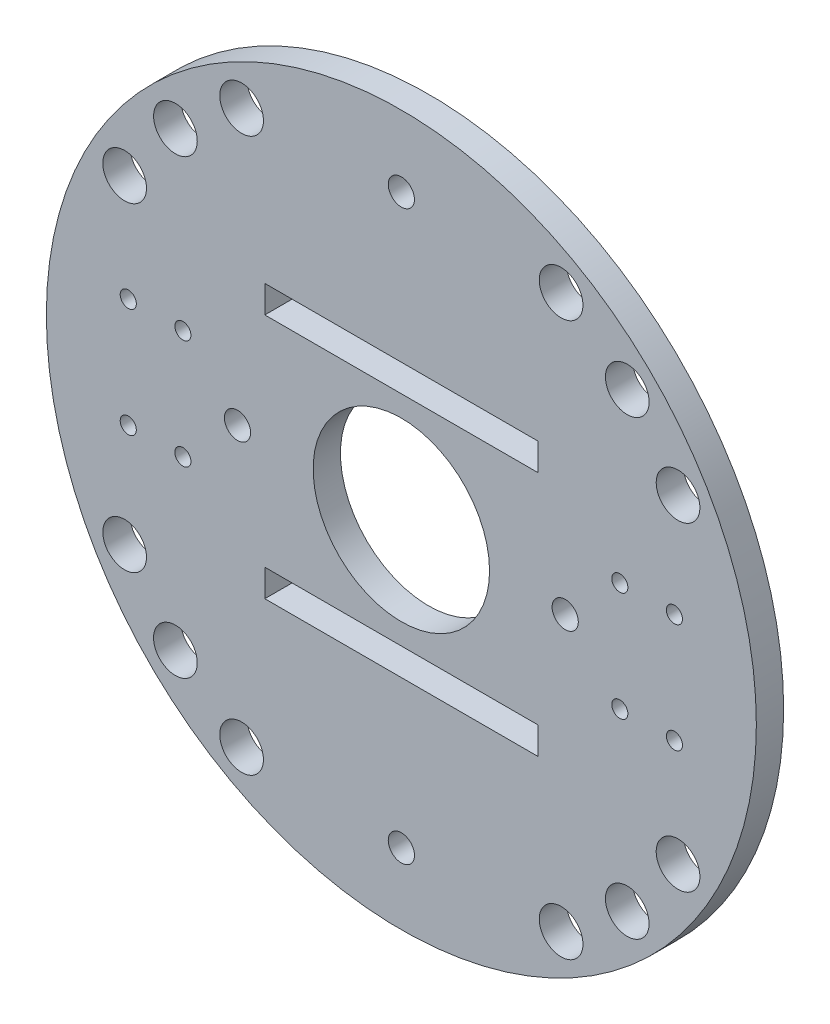
ISO-10303-21;
HEADER;
FILE_DESCRIPTION(('STEP AP214'),'2;1');
FILE_NAME('part.step','',(''),(''),'','','');
FILE_SCHEMA(('AUTOMOTIVE_DESIGN { 1 0 10303 214 1 1 1 1 }'));
ENDSEC;
DATA;
#1=APPLICATION_CONTEXT('core data for automotive mechanical design processes');
#2=APPLICATION_PROTOCOL_DEFINITION('international standard','automotive_design',2000,#1);
#3=PRODUCT_CONTEXT('',#1,'mechanical');
#4=PRODUCT('Part','Part','',(#3));
#5=PRODUCT_RELATED_PRODUCT_CATEGORY('part','',(#4));
#6=PRODUCT_DEFINITION_FORMATION('','',#4);
#7=PRODUCT_DEFINITION_CONTEXT('part definition',#1,'design');
#8=PRODUCT_DEFINITION('design','',#6,#7);
#9=PRODUCT_DEFINITION_SHAPE('','',#8);
#10=(LENGTH_UNIT() NAMED_UNIT(*) SI_UNIT(.MILLI.,.METRE.));
#11=(NAMED_UNIT(*) PLANE_ANGLE_UNIT() SI_UNIT($,.RADIAN.));
#12=(NAMED_UNIT(*) SI_UNIT($,.STERADIAN.) SOLID_ANGLE_UNIT());
#13=UNCERTAINTY_MEASURE_WITH_UNIT(LENGTH_MEASURE(1.E-05),#10,'distance_accuracy_value','');
#14=(GEOMETRIC_REPRESENTATION_CONTEXT(3) GLOBAL_UNCERTAINTY_ASSIGNED_CONTEXT((#13)) GLOBAL_UNIT_ASSIGNED_CONTEXT((#10,
#11,#12)) REPRESENTATION_CONTEXT('',''));
#15=CARTESIAN_POINT('',(0.,0.,0.));
#16=DIRECTION('',(0.,0.,1.));
#17=DIRECTION('',(1.,0.,0.));
#18=AXIS2_PLACEMENT_3D('',#15,#16,#17);
#19=CARTESIAN_POINT('',(0.,0.,5.));
#20=DIRECTION('',(0.,0.,1.));
#21=DIRECTION('',(1.,0.,0.));
#22=AXIS2_PLACEMENT_3D('',#19,#20,#21);
#23=PLANE('',#22);
#24=CARTESIAN_POINT('',(40.,9.99999999999999,5.));
#25=DIRECTION('',(0.,0.,1.));
#26=DIRECTION('',(-1.,0.,0.));
#27=AXIS2_PLACEMENT_3D('',#24,#25,#26);
#28=CIRCLE('',#27,1.475);
#29=CARTESIAN_POINT('',(38.525,9.99999999999999,5.));
#30=VERTEX_POINT('',#29);
#31=EDGE_CURVE('E223',#30,#30,#28,.T.);
#32=ORIENTED_EDGE('',*,*,#31,.F.);
#33=EDGE_LOOP('',(#32));
#34=FACE_BOUND('',#33,.T.);
#35=CARTESIAN_POINT('',(50.,-9.99999999999999,5.));
#36=DIRECTION('',(0.,0.,1.));
#37=DIRECTION('',(1.,0.,0.));
#38=AXIS2_PLACEMENT_3D('',#35,#36,#37);
#39=CIRCLE('',#38,1.475);
#40=CARTESIAN_POINT('',(51.475,-9.99999999999999,5.));
#41=VERTEX_POINT('',#40);
#42=EDGE_CURVE('E227',#41,#41,#39,.T.);
#43=ORIENTED_EDGE('',*,*,#42,.F.);
#44=EDGE_LOOP('',(#43));
#45=FACE_BOUND('',#44,.T.);
#46=CARTESIAN_POINT('',(-40.,-9.99999999999999,5.));
#47=DIRECTION('',(0.,0.,1.));
#48=DIRECTION('',(-1.,0.,0.));
#49=AXIS2_PLACEMENT_3D('',#46,#47,#48);
#50=CIRCLE('',#49,1.475);
#51=CARTESIAN_POINT('',(-41.475,-9.99999999999999,5.));
#52=VERTEX_POINT('',#51);
#53=EDGE_CURVE('E231',#52,#52,#50,.T.);
#54=ORIENTED_EDGE('',*,*,#53,.F.);
#55=EDGE_LOOP('',(#54));
#56=FACE_BOUND('',#55,.T.);
#57=CARTESIAN_POINT('',(-40.,9.99999999999999,5.));
#58=DIRECTION('',(0.,0.,1.));
#59=DIRECTION('',(1.,0.,0.));
#60=AXIS2_PLACEMENT_3D('',#57,#58,#59);
#61=CIRCLE('',#60,1.475);
#62=CARTESIAN_POINT('',(-38.525,9.99999999999999,5.));
#63=VERTEX_POINT('',#62);
#64=EDGE_CURVE('E235',#63,#63,#61,.T.);
#65=ORIENTED_EDGE('',*,*,#64,.F.);
#66=EDGE_LOOP('',(#65));
#67=FACE_BOUND('',#66,.T.);
#68=CARTESIAN_POINT('',(-41.3657466994133,-41.3657466994128,5.));
#69=DIRECTION('',(0.,0.,1.));
#70=DIRECTION('',(-1.,0.,0.));
#71=AXIS2_PLACEMENT_3D('',#68,#69,#70);
#72=CIRCLE('',#71,4.);
#73=CARTESIAN_POINT('',(-45.3657466994133,-41.3657466994128,5.));
#74=VERTEX_POINT('',#73);
#75=EDGE_CURVE('E239',#74,#74,#72,.T.);
#76=ORIENTED_EDGE('',*,*,#75,.F.);
#77=EDGE_LOOP('',(#76));
#78=FACE_BOUND('',#77,.T.);
#79=CARTESIAN_POINT('',(29.2500000000002,-50.6624861213895,5.));
#80=DIRECTION('',(0.,0.,1.));
#81=DIRECTION('',(1.,0.,0.));
#82=AXIS2_PLACEMENT_3D('',#79,#80,#81);
#83=CIRCLE('',#82,4.);
#84=CARTESIAN_POINT('',(33.2500000000002,-50.6624861213895,5.));
#85=VERTEX_POINT('',#84);
#86=EDGE_CURVE('E243',#85,#85,#83,.T.);
#87=ORIENTED_EDGE('',*,*,#86,.F.);
#88=EDGE_LOOP('',(#87));
#89=FACE_BOUND('',#88,.T.);
#90=CARTESIAN_POINT('',(50.6624861213898,-29.2499999999997,5.));
#91=DIRECTION('',(0.,0.,1.));
#92=DIRECTION('',(1.,0.,0.));
#93=AXIS2_PLACEMENT_3D('',#90,#91,#92);
#94=CIRCLE('',#93,4.);
#95=CARTESIAN_POINT('',(54.6624861213898,-29.2499999999997,5.));
#96=VERTEX_POINT('',#95);
#97=EDGE_CURVE('E247',#96,#96,#94,.T.);
#98=ORIENTED_EDGE('',*,*,#97,.F.);
#99=EDGE_LOOP('',(#98));
#100=FACE_BOUND('',#99,.T.);
#101=CARTESIAN_POINT('',(-50.6624861213898,29.2499999999997,5.));
#102=DIRECTION('',(0.,0.,1.));
#103=DIRECTION('',(1.,0.,0.));
#104=AXIS2_PLACEMENT_3D('',#101,#102,#103);
#105=CIRCLE('',#104,4.);
#106=CARTESIAN_POINT('',(-46.6624861213899,29.2499999999997,5.));
#107=VERTEX_POINT('',#106);
#108=EDGE_CURVE('E251',#107,#107,#105,.T.);
#109=ORIENTED_EDGE('',*,*,#108,.F.);
#110=EDGE_LOOP('',(#109));
#111=FACE_BOUND('',#110,.T.);
#112=CARTESIAN_POINT('',(50.6624861213898,29.2499999999997,5.));
#113=DIRECTION('',(0.,0.,1.));
#114=DIRECTION('',(-1.,0.,0.));
#115=AXIS2_PLACEMENT_3D('',#112,#113,#114);
#116=CIRCLE('',#115,4.);
#117=CARTESIAN_POINT('',(46.6624861213899,29.2499999999997,5.));
#118=VERTEX_POINT('',#117);
#119=EDGE_CURVE('E255',#118,#118,#116,.T.);
#120=ORIENTED_EDGE('',*,*,#119,.F.);
#121=EDGE_LOOP('',(#120));
#122=FACE_BOUND('',#121,.T.);
#123=CARTESIAN_POINT('',(-41.3657466994133,41.3657466994128,5.));
#124=DIRECTION('',(0.,0.,1.));
#125=DIRECTION('',(1.,0.,0.));
#126=AXIS2_PLACEMENT_3D('',#123,#124,#125);
#127=CIRCLE('',#126,4.);
#128=CARTESIAN_POINT('',(-37.3657466994133,41.3657466994128,5.));
#129=VERTEX_POINT('',#128);
#130=EDGE_CURVE('E126',#129,#129,#127,.T.);
#131=ORIENTED_EDGE('',*,*,#130,.F.);
#132=EDGE_LOOP('',(#131));
#133=FACE_BOUND('',#132,.T.);
#134=CARTESIAN_POINT('',(0.,-52.,5.));
#135=DIRECTION('',(0.,0.,1.));
#136=DIRECTION('',(-1.,0.,0.));
#137=AXIS2_PLACEMENT_3D('',#134,#135,#136);
#138=CIRCLE('',#137,2.4);
#139=CARTESIAN_POINT('',(-2.4,-52.,5.));
#140=VERTEX_POINT('',#139);
#141=EDGE_CURVE('E173',#140,#140,#138,.T.);
#142=ORIENTED_EDGE('',*,*,#141,.F.);
#143=EDGE_LOOP('',(#142));
#144=FACE_BOUND('',#143,.T.);
#145=CARTESIAN_POINT('',(0.,52.,5.));
#146=DIRECTION('',(0.,0.,1.));
#147=DIRECTION('',(1.,0.,0.));
#148=AXIS2_PLACEMENT_3D('',#145,#146,#147);
#149=CIRCLE('',#148,2.4);
#150=CARTESIAN_POINT('',(2.4,52.,5.));
#151=VERTEX_POINT('',#150);
#152=EDGE_CURVE('E185',#151,#151,#149,.T.);
#153=ORIENTED_EDGE('',*,*,#152,.F.);
#154=EDGE_LOOP('',(#153));
#155=FACE_BOUND('',#154,.T.);
#156=CARTESIAN_POINT('',(0.,0.,5.));
#157=DIRECTION('',(0.,0.,1.));
#158=DIRECTION('',(1.,0.,0.));
#159=AXIS2_PLACEMENT_3D('',#156,#157,#158);
#160=CIRCLE('',#159,65.);
#161=CARTESIAN_POINT('',(65.,0.,5.));
#162=VERTEX_POINT('',#161);
#163=EDGE_CURVE('E11',#162,#162,#160,.T.);
#164=ORIENTED_EDGE('',*,*,#163,.T.);
#165=EDGE_LOOP('',(#164));
#166=FACE_BOUND('',#165,.T.);
#167=CARTESIAN_POINT('',(0.,0.,5.));
#168=DIRECTION('',(0.,0.,1.));
#169=DIRECTION('',(1.,0.,0.));
#170=AXIS2_PLACEMENT_3D('',#167,#168,#169);
#171=CIRCLE('',#170,16.15);
#172=CARTESIAN_POINT('',(16.15,0.,5.));
#173=VERTEX_POINT('',#172);
#174=EDGE_CURVE('E191',#173,#173,#171,.T.);
#175=ORIENTED_EDGE('',*,*,#174,.F.);
#176=EDGE_LOOP('',(#175));
#177=FACE_BOUND('',#176,.T.);
#178=CARTESIAN_POINT('',(-30.,0.,5.));
#179=DIRECTION('',(0.,0.,1.));
#180=DIRECTION('',(1.,0.,0.));
#181=AXIS2_PLACEMENT_3D('',#178,#179,#180);
#182=CIRCLE('',#181,2.4);
#183=CARTESIAN_POINT('',(-27.6,0.,5.));
#184=VERTEX_POINT('',#183);
#185=EDGE_CURVE('E179',#184,#184,#182,.T.);
#186=ORIENTED_EDGE('',*,*,#185,.F.);
#187=EDGE_LOOP('',(#186));
#188=FACE_BOUND('',#187,.T.);
#189=CARTESIAN_POINT('',(30.,0.,5.));
#190=DIRECTION('',(0.,0.,1.));
#191=DIRECTION('',(-1.,0.,0.));
#192=AXIS2_PLACEMENT_3D('',#189,#190,#191);
#193=CIRCLE('',#192,2.4);
#194=CARTESIAN_POINT('',(27.6,0.,5.));
#195=VERTEX_POINT('',#194);
#196=EDGE_CURVE('E167',#195,#195,#193,.T.);
#197=ORIENTED_EDGE('',*,*,#196,.F.);
#198=EDGE_LOOP('',(#197));
#199=FACE_BOUND('',#198,.T.);
#200=DIRECTION('',(1.,0.,0.));
#201=VECTOR('',#200,1.);
#202=CARTESIAN_POINT('',(-25.,20.,5.));
#203=LINE('',#202,#201);
#204=CARTESIAN_POINT('',(-25.,20.,5.));
#205=VERTEX_POINT('',#204);
#206=CARTESIAN_POINT('',(25.,20.,5.));
#207=VERTEX_POINT('',#206);
#208=EDGE_CURVE('E138',#205,#207,#203,.T.);
#209=ORIENTED_EDGE('',*,*,#208,.F.);
#210=DIRECTION('',(0.,-1.,0.));
#211=VECTOR('',#210,1.);
#212=CARTESIAN_POINT('',(-25.,25.,5.));
#213=LINE('',#212,#211);
#214=CARTESIAN_POINT('',(-25.,25.,5.));
#215=VERTEX_POINT('',#214);
#216=EDGE_CURVE('E136',#215,#205,#213,.T.);
#217=ORIENTED_EDGE('',*,*,#216,.F.);
#218=DIRECTION('',(-1.,0.,0.));
#219=VECTOR('',#218,1.);
#220=CARTESIAN_POINT('',(-25.,25.,5.));
#221=LINE('',#220,#219);
#222=CARTESIAN_POINT('',(25.,25.,5.));
#223=VERTEX_POINT('',#222);
#224=EDGE_CURVE('E144',#223,#215,#221,.T.);
#225=ORIENTED_EDGE('',*,*,#224,.F.);
#226=DIRECTION('',(0.,1.,0.));
#227=VECTOR('',#226,1.);
#228=CARTESIAN_POINT('',(25.,25.,5.));
#229=LINE('',#228,#227);
#230=EDGE_CURVE('E141',#207,#223,#229,.T.);
#231=ORIENTED_EDGE('',*,*,#230,.F.);
#232=EDGE_LOOP('',(#209,#217,#225,#231));
#233=FACE_BOUND('',#232,.T.);
#234=DIRECTION('',(0.,1.,0.));
#235=VECTOR('',#234,1.);
#236=CARTESIAN_POINT('',(25.,-25.,5.));
#237=LINE('',#236,#235);
#238=CARTESIAN_POINT('',(25.,-25.,5.));
#239=VERTEX_POINT('',#238);
#240=CARTESIAN_POINT('',(25.,-20.,5.));
#241=VERTEX_POINT('',#240);
#242=EDGE_CURVE('E105',#239,#241,#237,.T.);
#243=ORIENTED_EDGE('',*,*,#242,.F.);
#244=DIRECTION('',(1.,0.,0.));
#245=VECTOR('',#244,1.);
#246=CARTESIAN_POINT('',(-25.,-25.,5.));
#247=LINE('',#246,#245);
#248=CARTESIAN_POINT('',(-25.,-25.,5.));
#249=VERTEX_POINT('',#248);
#250=EDGE_CURVE('E97',#249,#239,#247,.T.);
#251=ORIENTED_EDGE('',*,*,#250,.F.);
#252=DIRECTION('',(0.,-1.,0.));
#253=VECTOR('',#252,1.);
#254=CARTESIAN_POINT('',(-25.,-25.,5.));
#255=LINE('',#254,#253);
#256=CARTESIAN_POINT('',(-25.,-20.,5.));
#257=VERTEX_POINT('',#256);
#258=EDGE_CURVE('E120',#257,#249,#255,.T.);
#259=ORIENTED_EDGE('',*,*,#258,.F.);
#260=DIRECTION('',(-1.,0.,0.));
#261=VECTOR('',#260,1.);
#262=CARTESIAN_POINT('',(-25.,-20.,5.));
#263=LINE('',#262,#261);
#264=EDGE_CURVE('E118',#241,#257,#263,.T.);
#265=ORIENTED_EDGE('',*,*,#264,.F.);
#266=EDGE_LOOP('',(#243,#251,#259,#265));
#267=FACE_BOUND('',#266,.T.);
#268=CARTESIAN_POINT('',(-29.2500000000002,50.6624861213895,5.));
#269=DIRECTION('',(0.,0.,1.));
#270=DIRECTION('',(1.,0.,0.));
#271=AXIS2_PLACEMENT_3D('',#268,#269,#270);
#272=CIRCLE('',#271,4.);
#273=CARTESIAN_POINT('',(-25.2500000000002,50.6624861213895,5.));
#274=VERTEX_POINT('',#273);
#275=EDGE_CURVE('E459',#274,#274,#272,.T.);
#276=ORIENTED_EDGE('',*,*,#275,.F.);
#277=EDGE_LOOP('',(#276));
#278=FACE_BOUND('',#277,.T.);
#279=CARTESIAN_POINT('',(41.3657466994133,41.3657466994128,5.));
#280=DIRECTION('',(0.,0.,1.));
#281=DIRECTION('',(-1.,0.,0.));
#282=AXIS2_PLACEMENT_3D('',#279,#280,#281);
#283=CIRCLE('',#282,4.);
#284=CARTESIAN_POINT('',(37.3657466994133,41.3657466994128,5.));
#285=VERTEX_POINT('',#284);
#286=EDGE_CURVE('E453',#285,#285,#283,.T.);
#287=ORIENTED_EDGE('',*,*,#286,.F.);
#288=EDGE_LOOP('',(#287));
#289=FACE_BOUND('',#288,.T.);
#290=CARTESIAN_POINT('',(29.2500000000002,50.6624861213895,5.));
#291=DIRECTION('',(0.,0.,1.));
#292=DIRECTION('',(-1.,0.,0.));
#293=AXIS2_PLACEMENT_3D('',#290,#291,#292);
#294=CIRCLE('',#293,4.);
#295=CARTESIAN_POINT('',(25.2500000000002,50.6624861213895,5.));
#296=VERTEX_POINT('',#295);
#297=EDGE_CURVE('E447',#296,#296,#294,.T.);
#298=ORIENTED_EDGE('',*,*,#297,.F.);
#299=EDGE_LOOP('',(#298));
#300=FACE_BOUND('',#299,.T.);
#301=CARTESIAN_POINT('',(41.3657466994133,-41.3657466994128,5.));
#302=DIRECTION('',(0.,0.,1.));
#303=DIRECTION('',(1.,0.,0.));
#304=AXIS2_PLACEMENT_3D('',#301,#302,#303);
#305=CIRCLE('',#304,4.);
#306=CARTESIAN_POINT('',(45.3657466994133,-41.3657466994128,5.));
#307=VERTEX_POINT('',#306);
#308=EDGE_CURVE('E441',#307,#307,#305,.T.);
#309=ORIENTED_EDGE('',*,*,#308,.F.);
#310=EDGE_LOOP('',(#309));
#311=FACE_BOUND('',#310,.T.);
#312=CARTESIAN_POINT('',(-29.2500000000002,-50.6624861213895,5.));
#313=DIRECTION('',(0.,0.,1.));
#314=DIRECTION('',(-1.,0.,0.));
#315=AXIS2_PLACEMENT_3D('',#312,#313,#314);
#316=CIRCLE('',#315,4.);
#317=CARTESIAN_POINT('',(-33.2500000000002,-50.6624861213895,5.));
#318=VERTEX_POINT('',#317);
#319=EDGE_CURVE('E435',#318,#318,#316,.T.);
#320=ORIENTED_EDGE('',*,*,#319,.F.);
#321=EDGE_LOOP('',(#320));
#322=FACE_BOUND('',#321,.T.);
#323=CARTESIAN_POINT('',(-50.6624861213898,-29.2499999999997,5.));
#324=DIRECTION('',(0.,0.,1.));
#325=DIRECTION('',(-1.,0.,0.));
#326=AXIS2_PLACEMENT_3D('',#323,#324,#325);
#327=CIRCLE('',#326,4.);
#328=CARTESIAN_POINT('',(-54.6624861213898,-29.2499999999997,5.));
#329=VERTEX_POINT('',#328);
#330=EDGE_CURVE('E429',#329,#329,#327,.T.);
#331=ORIENTED_EDGE('',*,*,#330,.F.);
#332=EDGE_LOOP('',(#331));
#333=FACE_BOUND('',#332,.T.);
#334=CARTESIAN_POINT('',(-50.,9.99999999999999,5.));
#335=DIRECTION('',(0.,0.,1.));
#336=DIRECTION('',(1.,0.,0.));
#337=AXIS2_PLACEMENT_3D('',#334,#335,#336);
#338=CIRCLE('',#337,1.475);
#339=CARTESIAN_POINT('',(-48.525,9.99999999999999,5.));
#340=VERTEX_POINT('',#339);
#341=EDGE_CURVE('E423',#340,#340,#338,.T.);
#342=ORIENTED_EDGE('',*,*,#341,.F.);
#343=EDGE_LOOP('',(#342));
#344=FACE_BOUND('',#343,.T.);
#345=CARTESIAN_POINT('',(-50.,-9.99999999999999,5.));
#346=DIRECTION('',(0.,0.,1.));
#347=DIRECTION('',(-1.,0.,0.));
#348=AXIS2_PLACEMENT_3D('',#345,#346,#347);
#349=CIRCLE('',#348,1.475);
#350=CARTESIAN_POINT('',(-51.475,-9.99999999999999,5.));
#351=VERTEX_POINT('',#350);
#352=EDGE_CURVE('E417',#351,#351,#349,.T.);
#353=ORIENTED_EDGE('',*,*,#352,.F.);
#354=EDGE_LOOP('',(#353));
#355=FACE_BOUND('',#354,.T.);
#356=CARTESIAN_POINT('',(40.,-9.99999999999999,5.));
#357=DIRECTION('',(0.,0.,1.));
#358=DIRECTION('',(1.,0.,0.));
#359=AXIS2_PLACEMENT_3D('',#356,#357,#358);
#360=CIRCLE('',#359,1.475);
#361=CARTESIAN_POINT('',(41.475,-9.99999999999999,5.));
#362=VERTEX_POINT('',#361);
#363=EDGE_CURVE('E411',#362,#362,#360,.T.);
#364=ORIENTED_EDGE('',*,*,#363,.F.);
#365=EDGE_LOOP('',(#364));
#366=FACE_BOUND('',#365,.T.);
#367=CARTESIAN_POINT('',(50.,9.99999999999999,5.));
#368=DIRECTION('',(0.,0.,1.));
#369=DIRECTION('',(-1.,0.,0.));
#370=AXIS2_PLACEMENT_3D('',#367,#368,#369);
#371=CIRCLE('',#370,1.475);
#372=CARTESIAN_POINT('',(48.525,9.99999999999999,5.));
#373=VERTEX_POINT('',#372);
#374=EDGE_CURVE('E404',#373,#373,#371,.T.);
#375=ORIENTED_EDGE('',*,*,#374,.F.);
#376=EDGE_LOOP('',(#375));
#377=FACE_BOUND('',#376,.T.);
#378=ADVANCED_FACE('F32',(#34,#45,#56,#67,#78,#89,#100,#111,#122,#133,#144,#155,#166,#177,#188,
#199,#233,#267,#278,#289,#300,#311,#322,#333,#344,#355,#366,#377),#23,.T.);
#379=CARTESIAN_POINT('',(0.,0.,0.));
#380=DIRECTION('',(0.,0.,1.));
#381=DIRECTION('',(1.,0.,0.));
#382=AXIS2_PLACEMENT_3D('',#379,#380,#381);
#383=PLANE('',#382);
#384=DIRECTION('',(0.,-1.,0.));
#385=VECTOR('',#384,1.);
#386=CARTESIAN_POINT('',(-25.,25.,0.));
#387=LINE('',#386,#385);
#388=CARTESIAN_POINT('',(-25.,25.,0.));
#389=VERTEX_POINT('',#388);
#390=CARTESIAN_POINT('',(-25.,20.,0.));
#391=VERTEX_POINT('',#390);
#392=EDGE_CURVE('E113',#389,#391,#387,.T.);
#393=ORIENTED_EDGE('',*,*,#392,.T.);
#394=DIRECTION('',(1.,0.,0.));
#395=VECTOR('',#394,1.);
#396=CARTESIAN_POINT('',(-25.,20.,0.));
#397=LINE('',#396,#395);
#398=CARTESIAN_POINT('',(25.,20.,0.));
#399=VERTEX_POINT('',#398);
#400=EDGE_CURVE('E149',#391,#399,#397,.T.);
#401=ORIENTED_EDGE('',*,*,#400,.T.);
#402=DIRECTION('',(0.,1.,0.));
#403=VECTOR('',#402,1.);
#404=CARTESIAN_POINT('',(25.,25.,0.));
#405=LINE('',#404,#403);
#406=CARTESIAN_POINT('',(25.,25.,0.));
#407=VERTEX_POINT('',#406);
#408=EDGE_CURVE('E152',#399,#407,#405,.T.);
#409=ORIENTED_EDGE('',*,*,#408,.T.);
#410=DIRECTION('',(-1.,0.,0.));
#411=VECTOR('',#410,1.);
#412=CARTESIAN_POINT('',(-25.,25.,0.));
#413=LINE('',#412,#411);
#414=EDGE_CURVE('E139',#407,#389,#413,.T.);
#415=ORIENTED_EDGE('',*,*,#414,.T.);
#416=EDGE_LOOP('',(#393,#401,#409,#415));
#417=FACE_BOUND('',#416,.T.);
#418=CARTESIAN_POINT('',(0.,0.,0.));
#419=DIRECTION('',(0.,0.,1.));
#420=DIRECTION('',(1.,0.,0.));
#421=AXIS2_PLACEMENT_3D('',#418,#419,#420);
#422=CIRCLE('',#421,65.);
#423=CARTESIAN_POINT('',(65.,0.,0.));
#424=VERTEX_POINT('',#423);
#425=EDGE_CURVE('E36',#424,#424,#422,.T.);
#426=ORIENTED_EDGE('',*,*,#425,.F.);
#427=EDGE_LOOP('',(#426));
#428=FACE_BOUND('',#427,.T.);
#429=CARTESIAN_POINT('',(0.,0.,0.));
#430=DIRECTION('',(0.,0.,1.));
#431=DIRECTION('',(1.,0.,0.));
#432=AXIS2_PLACEMENT_3D('',#429,#430,#431);
#433=CIRCLE('',#432,16.15);
#434=CARTESIAN_POINT('',(16.15,0.,0.));
#435=VERTEX_POINT('',#434);
#436=EDGE_CURVE('E188',#435,#435,#433,.T.);
#437=ORIENTED_EDGE('',*,*,#436,.T.);
#438=EDGE_LOOP('',(#437));
#439=FACE_BOUND('',#438,.T.);
#440=CARTESIAN_POINT('',(0.,52.,0.));
#441=DIRECTION('',(0.,0.,1.));
#442=DIRECTION('',(1.,0.,0.));
#443=AXIS2_PLACEMENT_3D('',#440,#441,#442);
#444=CIRCLE('',#443,2.4);
#445=CARTESIAN_POINT('',(2.4,52.,0.));
#446=VERTEX_POINT('',#445);
#447=EDGE_CURVE('E182',#446,#446,#444,.T.);
#448=ORIENTED_EDGE('',*,*,#447,.T.);
#449=EDGE_LOOP('',(#448));
#450=FACE_BOUND('',#449,.T.);
#451=CARTESIAN_POINT('',(-30.,0.,0.));
#452=DIRECTION('',(0.,0.,1.));
#453=DIRECTION('',(1.,0.,0.));
#454=AXIS2_PLACEMENT_3D('',#451,#452,#453);
#455=CIRCLE('',#454,2.4);
#456=CARTESIAN_POINT('',(-27.6,0.,0.));
#457=VERTEX_POINT('',#456);
#458=EDGE_CURVE('E176',#457,#457,#455,.T.);
#459=ORIENTED_EDGE('',*,*,#458,.T.);
#460=EDGE_LOOP('',(#459));
#461=FACE_BOUND('',#460,.T.);
#462=CARTESIAN_POINT('',(0.,-52.,0.));
#463=DIRECTION('',(0.,0.,1.));
#464=DIRECTION('',(-1.,0.,0.));
#465=AXIS2_PLACEMENT_3D('',#462,#463,#464);
#466=CIRCLE('',#465,2.4);
#467=CARTESIAN_POINT('',(-2.4,-52.,0.));
#468=VERTEX_POINT('',#467);
#469=EDGE_CURVE('E170',#468,#468,#466,.T.);
#470=ORIENTED_EDGE('',*,*,#469,.T.);
#471=EDGE_LOOP('',(#470));
#472=FACE_BOUND('',#471,.T.);
#473=CARTESIAN_POINT('',(30.,0.,0.));
#474=DIRECTION('',(0.,0.,1.));
#475=DIRECTION('',(-1.,0.,0.));
#476=AXIS2_PLACEMENT_3D('',#473,#474,#475);
#477=CIRCLE('',#476,2.4);
#478=CARTESIAN_POINT('',(27.6,0.,0.));
#479=VERTEX_POINT('',#478);
#480=EDGE_CURVE('E166',#479,#479,#477,.T.);
#481=ORIENTED_EDGE('',*,*,#480,.T.);
#482=EDGE_LOOP('',(#481));
#483=FACE_BOUND('',#482,.T.);
#484=DIRECTION('',(1.,0.,0.));
#485=VECTOR('',#484,1.);
#486=CARTESIAN_POINT('',(-25.,-25.,0.));
#487=LINE('',#486,#485);
#488=CARTESIAN_POINT('',(-25.,-25.,0.));
#489=VERTEX_POINT('',#488);
#490=CARTESIAN_POINT('',(25.,-25.,0.));
#491=VERTEX_POINT('',#490);
#492=EDGE_CURVE('E55',#489,#491,#487,.T.);
#493=ORIENTED_EDGE('',*,*,#492,.T.);
#494=DIRECTION('',(0.,1.,0.));
#495=VECTOR('',#494,1.);
#496=CARTESIAN_POINT('',(25.,-25.,0.));
#497=LINE('',#496,#495);
#498=CARTESIAN_POINT('',(25.,-20.,0.));
#499=VERTEX_POINT('',#498);
#500=EDGE_CURVE('E112',#491,#499,#497,.T.);
#501=ORIENTED_EDGE('',*,*,#500,.T.);
#502=DIRECTION('',(-1.,0.,0.));
#503=VECTOR('',#502,1.);
#504=CARTESIAN_POINT('',(-25.,-20.,0.));
#505=LINE('',#504,#503);
#506=CARTESIAN_POINT('',(-25.,-20.,0.));
#507=VERTEX_POINT('',#506);
#508=EDGE_CURVE('E128',#499,#507,#505,.T.);
#509=ORIENTED_EDGE('',*,*,#508,.T.);
#510=DIRECTION('',(0.,-1.,0.));
#511=VECTOR('',#510,1.);
#512=CARTESIAN_POINT('',(-25.,-25.,0.));
#513=LINE('',#512,#511);
#514=EDGE_CURVE('E106',#507,#489,#513,.T.);
#515=ORIENTED_EDGE('',*,*,#514,.T.);
#516=EDGE_LOOP('',(#493,#501,#509,#515));
#517=FACE_BOUND('',#516,.T.);
#518=CARTESIAN_POINT('',(-41.3657466994133,41.3657466994128,0.));
#519=DIRECTION('',(0.,0.,1.));
#520=DIRECTION('',(1.,0.,0.));
#521=AXIS2_PLACEMENT_3D('',#518,#519,#520);
#522=CIRCLE('',#521,4.);
#523=CARTESIAN_POINT('',(-37.3657466994133,41.3657466994128,0.));
#524=VERTEX_POINT('',#523);
#525=EDGE_CURVE('E327',#524,#524,#522,.T.);
#526=ORIENTED_EDGE('',*,*,#525,.T.);
#527=EDGE_LOOP('',(#526));
#528=FACE_BOUND('',#527,.T.);
#529=CARTESIAN_POINT('',(-29.2500000000002,50.6624861213895,0.));
#530=DIRECTION('',(0.,0.,1.));
#531=DIRECTION('',(1.,0.,0.));
#532=AXIS2_PLACEMENT_3D('',#529,#530,#531);
#533=CIRCLE('',#532,4.);
#534=CARTESIAN_POINT('',(-25.2500000000002,50.6624861213895,0.));
#535=VERTEX_POINT('',#534);
#536=EDGE_CURVE('E331',#535,#535,#533,.T.);
#537=ORIENTED_EDGE('',*,*,#536,.T.);
#538=EDGE_LOOP('',(#537));
#539=FACE_BOUND('',#538,.T.);
#540=CARTESIAN_POINT('',(50.6624861213898,29.2499999999997,0.));
#541=DIRECTION('',(0.,0.,1.));
#542=DIRECTION('',(-1.,0.,0.));
#543=AXIS2_PLACEMENT_3D('',#540,#541,#542);
#544=CIRCLE('',#543,4.);
#545=CARTESIAN_POINT('',(46.6624861213899,29.2499999999997,0.));
#546=VERTEX_POINT('',#545);
#547=EDGE_CURVE('E335',#546,#546,#544,.T.);
#548=ORIENTED_EDGE('',*,*,#547,.T.);
#549=EDGE_LOOP('',(#548));
#550=FACE_BOUND('',#549,.T.);
#551=CARTESIAN_POINT('',(41.3657466994133,41.3657466994128,0.));
#552=DIRECTION('',(0.,0.,1.));
#553=DIRECTION('',(-1.,0.,0.));
#554=AXIS2_PLACEMENT_3D('',#551,#552,#553);
#555=CIRCLE('',#554,4.);
#556=CARTESIAN_POINT('',(37.3657466994133,41.3657466994128,0.));
#557=VERTEX_POINT('',#556);
#558=EDGE_CURVE('E339',#557,#557,#555,.T.);
#559=ORIENTED_EDGE('',*,*,#558,.T.);
#560=EDGE_LOOP('',(#559));
#561=FACE_BOUND('',#560,.T.);
#562=CARTESIAN_POINT('',(-50.6624861213898,29.2499999999997,0.));
#563=DIRECTION('',(0.,0.,1.));
#564=DIRECTION('',(1.,0.,0.));
#565=AXIS2_PLACEMENT_3D('',#562,#563,#564);
#566=CIRCLE('',#565,4.);
#567=CARTESIAN_POINT('',(-46.6624861213899,29.2499999999997,0.));
#568=VERTEX_POINT('',#567);
#569=EDGE_CURVE('E343',#568,#568,#566,.T.);
#570=ORIENTED_EDGE('',*,*,#569,.T.);
#571=EDGE_LOOP('',(#570));
#572=FACE_BOUND('',#571,.T.);
#573=CARTESIAN_POINT('',(29.2500000000002,50.6624861213895,0.));
#574=DIRECTION('',(0.,0.,1.));
#575=DIRECTION('',(-1.,0.,0.));
#576=AXIS2_PLACEMENT_3D('',#573,#574,#575);
#577=CIRCLE('',#576,4.);
#578=CARTESIAN_POINT('',(25.2500000000002,50.6624861213895,0.));
#579=VERTEX_POINT('',#578);
#580=EDGE_CURVE('E347',#579,#579,#577,.T.);
#581=ORIENTED_EDGE('',*,*,#580,.T.);
#582=EDGE_LOOP('',(#581));
#583=FACE_BOUND('',#582,.T.);
#584=CARTESIAN_POINT('',(50.6624861213898,-29.2499999999997,0.));
#585=DIRECTION('',(0.,0.,1.));
#586=DIRECTION('',(1.,0.,0.));
#587=AXIS2_PLACEMENT_3D('',#584,#585,#586);
#588=CIRCLE('',#587,4.);
#589=CARTESIAN_POINT('',(54.6624861213898,-29.2499999999997,0.));
#590=VERTEX_POINT('',#589);
#591=EDGE_CURVE('E351',#590,#590,#588,.T.);
#592=ORIENTED_EDGE('',*,*,#591,.T.);
#593=EDGE_LOOP('',(#592));
#594=FACE_BOUND('',#593,.T.);
#595=CARTESIAN_POINT('',(41.3657466994133,-41.3657466994128,0.));
#596=DIRECTION('',(0.,0.,1.));
#597=DIRECTION('',(1.,0.,0.));
#598=AXIS2_PLACEMENT_3D('',#595,#596,#597);
#599=CIRCLE('',#598,4.);
#600=CARTESIAN_POINT('',(45.3657466994133,-41.3657466994128,0.));
#601=VERTEX_POINT('',#600);
#602=EDGE_CURVE('E355',#601,#601,#599,.T.);
#603=ORIENTED_EDGE('',*,*,#602,.T.);
#604=EDGE_LOOP('',(#603));
#605=FACE_BOUND('',#604,.T.);
#606=CARTESIAN_POINT('',(29.2500000000002,-50.6624861213895,0.));
#607=DIRECTION('',(0.,0.,1.));
#608=DIRECTION('',(1.,0.,0.));
#609=AXIS2_PLACEMENT_3D('',#606,#607,#608);
#610=CIRCLE('',#609,4.);
#611=CARTESIAN_POINT('',(33.2500000000002,-50.6624861213895,0.));
#612=VERTEX_POINT('',#611);
#613=EDGE_CURVE('E359',#612,#612,#610,.T.);
#614=ORIENTED_EDGE('',*,*,#613,.T.);
#615=EDGE_LOOP('',(#614));
#616=FACE_BOUND('',#615,.T.);
#617=CARTESIAN_POINT('',(-29.2500000000002,-50.6624861213895,0.));
#618=DIRECTION('',(0.,0.,1.));
#619=DIRECTION('',(-1.,0.,0.));
#620=AXIS2_PLACEMENT_3D('',#617,#618,#619);
#621=CIRCLE('',#620,4.);
#622=CARTESIAN_POINT('',(-33.2500000000002,-50.6624861213895,0.));
#623=VERTEX_POINT('',#622);
#624=EDGE_CURVE('E363',#623,#623,#621,.T.);
#625=ORIENTED_EDGE('',*,*,#624,.T.);
#626=EDGE_LOOP('',(#625));
#627=FACE_BOUND('',#626,.T.);
#628=CARTESIAN_POINT('',(-41.3657466994133,-41.3657466994128,0.));
#629=DIRECTION('',(0.,0.,1.));
#630=DIRECTION('',(-1.,0.,0.));
#631=AXIS2_PLACEMENT_3D('',#628,#629,#630);
#632=CIRCLE('',#631,4.);
#633=CARTESIAN_POINT('',(-45.3657466994133,-41.3657466994128,0.));
#634=VERTEX_POINT('',#633);
#635=EDGE_CURVE('E367',#634,#634,#632,.T.);
#636=ORIENTED_EDGE('',*,*,#635,.T.);
#637=EDGE_LOOP('',(#636));
#638=FACE_BOUND('',#637,.T.);
#639=CARTESIAN_POINT('',(-50.6624861213898,-29.2499999999997,0.));
#640=DIRECTION('',(0.,0.,1.));
#641=DIRECTION('',(-1.,0.,0.));
#642=AXIS2_PLACEMENT_3D('',#639,#640,#641);
#643=CIRCLE('',#642,4.);
#644=CARTESIAN_POINT('',(-54.6624861213898,-29.2499999999997,0.));
#645=VERTEX_POINT('',#644);
#646=EDGE_CURVE('E371',#645,#645,#643,.T.);
#647=ORIENTED_EDGE('',*,*,#646,.T.);
#648=EDGE_LOOP('',(#647));
#649=FACE_BOUND('',#648,.T.);
#650=CARTESIAN_POINT('',(-40.,9.99999999999999,0.));
#651=DIRECTION('',(0.,0.,1.));
#652=DIRECTION('',(1.,0.,0.));
#653=AXIS2_PLACEMENT_3D('',#650,#651,#652);
#654=CIRCLE('',#653,1.475);
#655=CARTESIAN_POINT('',(-38.525,9.99999999999999,0.));
#656=VERTEX_POINT('',#655);
#657=EDGE_CURVE('E375',#656,#656,#654,.T.);
#658=ORIENTED_EDGE('',*,*,#657,.T.);
#659=EDGE_LOOP('',(#658));
#660=FACE_BOUND('',#659,.T.);
#661=CARTESIAN_POINT('',(-50.,9.99999999999999,0.));
#662=DIRECTION('',(0.,0.,1.));
#663=DIRECTION('',(1.,0.,0.));
#664=AXIS2_PLACEMENT_3D('',#661,#662,#663);
#665=CIRCLE('',#664,1.475);
#666=CARTESIAN_POINT('',(-48.525,9.99999999999999,0.));
#667=VERTEX_POINT('',#666);
#668=EDGE_CURVE('E379',#667,#667,#665,.T.);
#669=ORIENTED_EDGE('',*,*,#668,.T.);
#670=EDGE_LOOP('',(#669));
#671=FACE_BOUND('',#670,.T.);
#672=CARTESIAN_POINT('',(-40.,-9.99999999999999,0.));
#673=DIRECTION('',(0.,0.,1.));
#674=DIRECTION('',(-1.,0.,0.));
#675=AXIS2_PLACEMENT_3D('',#672,#673,#674);
#676=CIRCLE('',#675,1.475);
#677=CARTESIAN_POINT('',(-41.475,-9.99999999999999,0.));
#678=VERTEX_POINT('',#677);
#679=EDGE_CURVE('E383',#678,#678,#676,.T.);
#680=ORIENTED_EDGE('',*,*,#679,.T.);
#681=EDGE_LOOP('',(#680));
#682=FACE_BOUND('',#681,.T.);
#683=CARTESIAN_POINT('',(-50.,-9.99999999999999,0.));
#684=DIRECTION('',(0.,0.,1.));
#685=DIRECTION('',(-1.,0.,0.));
#686=AXIS2_PLACEMENT_3D('',#683,#684,#685);
#687=CIRCLE('',#686,1.475);
#688=CARTESIAN_POINT('',(-51.475,-9.99999999999999,0.));
#689=VERTEX_POINT('',#688);
#690=EDGE_CURVE('E387',#689,#689,#687,.T.);
#691=ORIENTED_EDGE('',*,*,#690,.T.);
#692=EDGE_LOOP('',(#691));
#693=FACE_BOUND('',#692,.T.);
#694=CARTESIAN_POINT('',(50.,-9.99999999999999,0.));
#695=DIRECTION('',(0.,0.,1.));
#696=DIRECTION('',(1.,0.,0.));
#697=AXIS2_PLACEMENT_3D('',#694,#695,#696);
#698=CIRCLE('',#697,1.475);
#699=CARTESIAN_POINT('',(51.475,-9.99999999999999,0.));
#700=VERTEX_POINT('',#699);
#701=EDGE_CURVE('E391',#700,#700,#698,.T.);
#702=ORIENTED_EDGE('',*,*,#701,.T.);
#703=EDGE_LOOP('',(#702));
#704=FACE_BOUND('',#703,.T.);
#705=CARTESIAN_POINT('',(40.,-9.99999999999999,0.));
#706=DIRECTION('',(0.,0.,1.));
#707=DIRECTION('',(1.,0.,0.));
#708=AXIS2_PLACEMENT_3D('',#705,#706,#707);
#709=CIRCLE('',#708,1.475);
#710=CARTESIAN_POINT('',(41.475,-9.99999999999999,0.));
#711=VERTEX_POINT('',#710);
#712=EDGE_CURVE('E395',#711,#711,#709,.T.);
#713=ORIENTED_EDGE('',*,*,#712,.T.);
#714=EDGE_LOOP('',(#713));
#715=FACE_BOUND('',#714,.T.);
#716=CARTESIAN_POINT('',(40.,9.99999999999999,0.));
#717=DIRECTION('',(0.,0.,1.));
#718=DIRECTION('',(-1.,0.,0.));
#719=AXIS2_PLACEMENT_3D('',#716,#717,#718);
#720=CIRCLE('',#719,1.475);
#721=CARTESIAN_POINT('',(38.525,9.99999999999999,0.));
#722=VERTEX_POINT('',#721);
#723=EDGE_CURVE('E399',#722,#722,#720,.T.);
#724=ORIENTED_EDGE('',*,*,#723,.T.);
#725=EDGE_LOOP('',(#724));
#726=FACE_BOUND('',#725,.T.);
#727=CARTESIAN_POINT('',(50.,9.99999999999999,0.));
#728=DIRECTION('',(0.,0.,1.));
#729=DIRECTION('',(-1.,0.,0.));
#730=AXIS2_PLACEMENT_3D('',#727,#728,#729);
#731=CIRCLE('',#730,1.475);
#732=CARTESIAN_POINT('',(48.525,9.99999999999999,0.));
#733=VERTEX_POINT('',#732);
#734=EDGE_CURVE('E402',#733,#733,#731,.T.);
#735=ORIENTED_EDGE('',*,*,#734,.T.);
#736=EDGE_LOOP('',(#735));
#737=FACE_BOUND('',#736,.T.);
#738=ADVANCED_FACE('F197',(#417,#428,#439,#450,#461,#472,#483,#517,#528,#539,#550,#561,#572,
#583,#594,#605,#616,#627,#638,#649,#660,#671,#682,#693,#704,#715,#726,#737),#383,.F.);
#739=CARTESIAN_POINT('',(0.,0.,5.));
#740=DIRECTION('',(0.,0.,-1.));
#741=DIRECTION('',(-1.,0.,0.));
#742=AXIS2_PLACEMENT_3D('',#739,#740,#741);
#743=CYLINDRICAL_SURFACE('',#742,65.);
#744=ORIENTED_EDGE('',*,*,#163,.F.);
#745=EDGE_LOOP('',(#744));
#746=FACE_BOUND('',#745,.T.);
#747=ORIENTED_EDGE('',*,*,#425,.T.);
#748=EDGE_LOOP('',(#747));
#749=FACE_BOUND('',#748,.T.);
#750=ADVANCED_FACE('F34',(#746,#749),#743,.T.);
#751=CARTESIAN_POINT('',(0.,0.,5.));
#752=DIRECTION('',(0.,0.,-1.));
#753=DIRECTION('',(-1.,0.,0.));
#754=AXIS2_PLACEMENT_3D('',#751,#752,#753);
#755=CYLINDRICAL_SURFACE('',#754,16.15);
#756=ORIENTED_EDGE('',*,*,#174,.T.);
#757=EDGE_LOOP('',(#756));
#758=FACE_BOUND('',#757,.T.);
#759=ORIENTED_EDGE('',*,*,#436,.F.);
#760=EDGE_LOOP('',(#759));
#761=FACE_BOUND('',#760,.T.);
#762=ADVANCED_FACE('F200',(#758,#761),#755,.F.);
#763=CARTESIAN_POINT('',(0.,52.,5.));
#764=DIRECTION('',(0.,0.,-1.));
#765=DIRECTION('',(-1.,0.,0.));
#766=AXIS2_PLACEMENT_3D('',#763,#764,#765);
#767=CYLINDRICAL_SURFACE('',#766,2.4);
#768=ORIENTED_EDGE('',*,*,#152,.T.);
#769=EDGE_LOOP('',(#768));
#770=FACE_BOUND('',#769,.T.);
#771=ORIENTED_EDGE('',*,*,#447,.F.);
#772=EDGE_LOOP('',(#771));
#773=FACE_BOUND('',#772,.T.);
#774=ADVANCED_FACE('F202',(#770,#773),#767,.F.);
#775=CARTESIAN_POINT('',(-30.,0.,5.));
#776=DIRECTION('',(0.,0.,-1.));
#777=DIRECTION('',(-1.,0.,0.));
#778=AXIS2_PLACEMENT_3D('',#775,#776,#777);
#779=CYLINDRICAL_SURFACE('',#778,2.4);
#780=ORIENTED_EDGE('',*,*,#185,.T.);
#781=EDGE_LOOP('',(#780));
#782=FACE_BOUND('',#781,.T.);
#783=ORIENTED_EDGE('',*,*,#458,.F.);
#784=EDGE_LOOP('',(#783));
#785=FACE_BOUND('',#784,.T.);
#786=ADVANCED_FACE('F209',(#782,#785),#779,.F.);
#787=CARTESIAN_POINT('',(0.,-52.,5.));
#788=DIRECTION('',(0.,0.,-1.));
#789=DIRECTION('',(-1.,0.,0.));
#790=AXIS2_PLACEMENT_3D('',#787,#788,#789);
#791=CYLINDRICAL_SURFACE('',#790,2.4);
#792=ORIENTED_EDGE('',*,*,#141,.T.);
#793=EDGE_LOOP('',(#792));
#794=FACE_BOUND('',#793,.T.);
#795=ORIENTED_EDGE('',*,*,#469,.F.);
#796=EDGE_LOOP('',(#795));
#797=FACE_BOUND('',#796,.T.);
#798=ADVANCED_FACE('F306',(#794,#797),#791,.F.);
#799=CARTESIAN_POINT('',(30.,0.,5.));
#800=DIRECTION('',(0.,0.,-1.));
#801=DIRECTION('',(-1.,0.,0.));
#802=AXIS2_PLACEMENT_3D('',#799,#800,#801);
#803=CYLINDRICAL_SURFACE('',#802,2.4);
#804=ORIENTED_EDGE('',*,*,#196,.T.);
#805=EDGE_LOOP('',(#804));
#806=FACE_BOUND('',#805,.T.);
#807=ORIENTED_EDGE('',*,*,#480,.F.);
#808=EDGE_LOOP('',(#807));
#809=FACE_BOUND('',#808,.T.);
#810=ADVANCED_FACE('F303',(#806,#809),#803,.F.);
#811=CARTESIAN_POINT('',(-25.,25.,5.));
#812=DIRECTION('',(1.,0.,0.));
#813=DIRECTION('',(0.,0.,-1.));
#814=AXIS2_PLACEMENT_3D('',#811,#812,#813);
#815=PLANE('',#814);
#816=ORIENTED_EDGE('',*,*,#392,.F.);
#817=DIRECTION('',(0.,0.,-1.));
#818=VECTOR('',#817,1.);
#819=CARTESIAN_POINT('',(-25.,25.,5.));
#820=LINE('',#819,#818);
#821=EDGE_CURVE('E146',#215,#389,#820,.T.);
#822=ORIENTED_EDGE('',*,*,#821,.F.);
#823=ORIENTED_EDGE('',*,*,#216,.T.);
#824=DIRECTION('',(0.,0.,-1.));
#825=VECTOR('',#824,1.);
#826=CARTESIAN_POINT('',(-25.,20.,5.));
#827=LINE('',#826,#825);
#828=EDGE_CURVE('E163',#205,#391,#827,.T.);
#829=ORIENTED_EDGE('',*,*,#828,.T.);
#830=EDGE_LOOP('',(#816,#822,#823,#829));
#831=FACE_BOUND('',#830,.T.);
#832=ADVANCED_FACE('F285',(#831),#815,.T.);
#833=CARTESIAN_POINT('',(-25.,20.,5.));
#834=DIRECTION('',(0.,1.,0.));
#835=DIRECTION('',(0.,0.,1.));
#836=AXIS2_PLACEMENT_3D('',#833,#834,#835);
#837=PLANE('',#836);
#838=ORIENTED_EDGE('',*,*,#400,.F.);
#839=ORIENTED_EDGE('',*,*,#828,.F.);
#840=ORIENTED_EDGE('',*,*,#208,.T.);
#841=DIRECTION('',(0.,0.,-1.));
#842=VECTOR('',#841,1.);
#843=CARTESIAN_POINT('',(25.,20.,5.));
#844=LINE('',#843,#842);
#845=EDGE_CURVE('E161',#207,#399,#844,.T.);
#846=ORIENTED_EDGE('',*,*,#845,.T.);
#847=EDGE_LOOP('',(#838,#839,#840,#846));
#848=FACE_BOUND('',#847,.T.);
#849=ADVANCED_FACE('F278',(#848),#837,.T.);
#850=CARTESIAN_POINT('',(25.,25.,5.));
#851=DIRECTION('',(-1.,0.,0.));
#852=DIRECTION('',(0.,-1.,0.));
#853=AXIS2_PLACEMENT_3D('',#850,#851,#852);
#854=PLANE('',#853);
#855=ORIENTED_EDGE('',*,*,#408,.F.);
#856=ORIENTED_EDGE('',*,*,#845,.F.);
#857=ORIENTED_EDGE('',*,*,#230,.T.);
#858=DIRECTION('',(0.,0.,-1.));
#859=VECTOR('',#858,1.);
#860=CARTESIAN_POINT('',(25.,25.,5.));
#861=LINE('',#860,#859);
#862=EDGE_CURVE('E159',#223,#407,#861,.T.);
#863=ORIENTED_EDGE('',*,*,#862,.T.);
#864=EDGE_LOOP('',(#855,#856,#857,#863));
#865=FACE_BOUND('',#864,.T.);
#866=ADVANCED_FACE('F281',(#865),#854,.T.);
#867=CARTESIAN_POINT('',(-25.,25.,5.));
#868=DIRECTION('',(0.,-1.,0.));
#869=DIRECTION('',(1.,0.,0.));
#870=AXIS2_PLACEMENT_3D('',#867,#868,#869);
#871=PLANE('',#870);
#872=ORIENTED_EDGE('',*,*,#414,.F.);
#873=ORIENTED_EDGE('',*,*,#862,.F.);
#874=ORIENTED_EDGE('',*,*,#224,.T.);
#875=ORIENTED_EDGE('',*,*,#821,.T.);
#876=EDGE_LOOP('',(#872,#873,#874,#875));
#877=FACE_BOUND('',#876,.T.);
#878=ADVANCED_FACE('F288',(#877),#871,.T.);
#879=CARTESIAN_POINT('',(-25.,-25.,5.));
#880=DIRECTION('',(0.,1.,0.));
#881=DIRECTION('',(-1.,0.,0.));
#882=AXIS2_PLACEMENT_3D('',#879,#880,#881);
#883=PLANE('',#882);
#884=ORIENTED_EDGE('',*,*,#492,.F.);
#885=DIRECTION('',(0.,0.,-1.));
#886=VECTOR('',#885,1.);
#887=CARTESIAN_POINT('',(-25.,-25.,5.));
#888=LINE('',#887,#886);
#889=EDGE_CURVE('E101',#249,#489,#888,.T.);
#890=ORIENTED_EDGE('',*,*,#889,.F.);
#891=ORIENTED_EDGE('',*,*,#250,.T.);
#892=DIRECTION('',(0.,0.,-1.));
#893=VECTOR('',#892,1.);
#894=CARTESIAN_POINT('',(25.,-25.,5.));
#895=LINE('',#894,#893);
#896=EDGE_CURVE('E100',#239,#491,#895,.T.);
#897=ORIENTED_EDGE('',*,*,#896,.T.);
#898=EDGE_LOOP('',(#884,#890,#891,#897));
#899=FACE_BOUND('',#898,.T.);
#900=ADVANCED_FACE('F99',(#899),#883,.T.);
#901=CARTESIAN_POINT('',(25.,-25.,5.));
#902=DIRECTION('',(-1.,0.,0.));
#903=DIRECTION('',(0.,-1.,0.));
#904=AXIS2_PLACEMENT_3D('',#901,#902,#903);
#905=PLANE('',#904);
#906=ORIENTED_EDGE('',*,*,#500,.F.);
#907=ORIENTED_EDGE('',*,*,#896,.F.);
#908=ORIENTED_EDGE('',*,*,#242,.T.);
#909=DIRECTION('',(0.,0.,-1.));
#910=VECTOR('',#909,1.);
#911=CARTESIAN_POINT('',(25.,-20.,5.));
#912=LINE('',#911,#910);
#913=EDGE_CURVE('E114',#241,#499,#912,.T.);
#914=ORIENTED_EDGE('',*,*,#913,.T.);
#915=EDGE_LOOP('',(#906,#907,#908,#914));
#916=FACE_BOUND('',#915,.T.);
#917=ADVANCED_FACE('F109',(#916),#905,.T.);
#918=CARTESIAN_POINT('',(-25.,-20.,5.));
#919=DIRECTION('',(0.,-1.,0.));
#920=DIRECTION('',(0.,0.,-1.));
#921=AXIS2_PLACEMENT_3D('',#918,#919,#920);
#922=PLANE('',#921);
#923=ORIENTED_EDGE('',*,*,#508,.F.);
#924=ORIENTED_EDGE('',*,*,#913,.F.);
#925=ORIENTED_EDGE('',*,*,#264,.T.);
#926=DIRECTION('',(0.,0.,-1.));
#927=VECTOR('',#926,1.);
#928=CARTESIAN_POINT('',(-25.,-20.,5.));
#929=LINE('',#928,#927);
#930=EDGE_CURVE('E47',#257,#507,#929,.T.);
#931=ORIENTED_EDGE('',*,*,#930,.T.);
#932=EDGE_LOOP('',(#923,#924,#925,#931));
#933=FACE_BOUND('',#932,.T.);
#934=ADVANCED_FACE('F477',(#933),#922,.T.);
#935=CARTESIAN_POINT('',(-25.,-25.,5.));
#936=DIRECTION('',(1.,0.,0.));
#937=DIRECTION('',(0.,0.,-1.));
#938=AXIS2_PLACEMENT_3D('',#935,#936,#937);
#939=PLANE('',#938);
#940=ORIENTED_EDGE('',*,*,#514,.F.);
#941=ORIENTED_EDGE('',*,*,#930,.F.);
#942=ORIENTED_EDGE('',*,*,#258,.T.);
#943=ORIENTED_EDGE('',*,*,#889,.T.);
#944=EDGE_LOOP('',(#940,#941,#942,#943));
#945=FACE_BOUND('',#944,.T.);
#946=ADVANCED_FACE('F468',(#945),#939,.T.);
#947=CARTESIAN_POINT('',(-41.3657466994133,41.3657466994128,5.));
#948=DIRECTION('',(0.,0.,-1.));
#949=DIRECTION('',(-1.,0.,0.));
#950=AXIS2_PLACEMENT_3D('',#947,#948,#949);
#951=CYLINDRICAL_SURFACE('',#950,4.);
#952=ORIENTED_EDGE('',*,*,#130,.T.);
#953=EDGE_LOOP('',(#952));
#954=FACE_BOUND('',#953,.T.);
#955=ORIENTED_EDGE('',*,*,#525,.F.);
#956=EDGE_LOOP('',(#955));
#957=FACE_BOUND('',#956,.T.);
#958=ADVANCED_FACE('F464',(#954,#957),#951,.F.);
#959=CARTESIAN_POINT('',(-29.2500000000002,50.6624861213895,5.));
#960=DIRECTION('',(0.,0.,-1.));
#961=DIRECTION('',(-1.,0.,0.));
#962=AXIS2_PLACEMENT_3D('',#959,#960,#961);
#963=CYLINDRICAL_SURFACE('',#962,4.);
#964=ORIENTED_EDGE('',*,*,#275,.T.);
#965=EDGE_LOOP('',(#964));
#966=FACE_BOUND('',#965,.T.);
#967=ORIENTED_EDGE('',*,*,#536,.F.);
#968=EDGE_LOOP('',(#967));
#969=FACE_BOUND('',#968,.T.);
#970=ADVANCED_FACE('F467',(#966,#969),#963,.F.);
#971=CARTESIAN_POINT('',(50.6624861213898,29.2499999999997,5.));
#972=DIRECTION('',(0.,0.,-1.));
#973=DIRECTION('',(-1.,0.,0.));
#974=AXIS2_PLACEMENT_3D('',#971,#972,#973);
#975=CYLINDRICAL_SURFACE('',#974,4.);
#976=ORIENTED_EDGE('',*,*,#119,.T.);
#977=EDGE_LOOP('',(#976));
#978=FACE_BOUND('',#977,.T.);
#979=ORIENTED_EDGE('',*,*,#547,.F.);
#980=EDGE_LOOP('',(#979));
#981=FACE_BOUND('',#980,.T.);
#982=ADVANCED_FACE('F474',(#978,#981),#975,.F.);
#983=CARTESIAN_POINT('',(41.3657466994133,41.3657466994128,5.));
#984=DIRECTION('',(0.,0.,-1.));
#985=DIRECTION('',(-1.,0.,0.));
#986=AXIS2_PLACEMENT_3D('',#983,#984,#985);
#987=CYLINDRICAL_SURFACE('',#986,4.);
#988=ORIENTED_EDGE('',*,*,#286,.T.);
#989=EDGE_LOOP('',(#988));
#990=FACE_BOUND('',#989,.T.);
#991=ORIENTED_EDGE('',*,*,#558,.F.);
#992=EDGE_LOOP('',(#991));
#993=FACE_BOUND('',#992,.T.);
#994=ADVANCED_FACE('F515',(#990,#993),#987,.F.);
#995=CARTESIAN_POINT('',(-50.6624861213898,29.2499999999997,5.));
#996=DIRECTION('',(0.,0.,-1.));
#997=DIRECTION('',(-1.,0.,0.));
#998=AXIS2_PLACEMENT_3D('',#995,#996,#997);
#999=CYLINDRICAL_SURFACE('',#998,4.);
#1000=ORIENTED_EDGE('',*,*,#108,.T.);
#1001=EDGE_LOOP('',(#1000));
#1002=FACE_BOUND('',#1001,.T.);
#1003=ORIENTED_EDGE('',*,*,#569,.F.);
#1004=EDGE_LOOP('',(#1003));
#1005=FACE_BOUND('',#1004,.T.);
#1006=ADVANCED_FACE('F524',(#1002,#1005),#999,.F.);
#1007=CARTESIAN_POINT('',(29.2500000000002,50.6624861213895,5.));
#1008=DIRECTION('',(0.,0.,-1.));
#1009=DIRECTION('',(-1.,0.,0.));
#1010=AXIS2_PLACEMENT_3D('',#1007,#1008,#1009);
#1011=CYLINDRICAL_SURFACE('',#1010,4.);
#1012=ORIENTED_EDGE('',*,*,#297,.T.);
#1013=EDGE_LOOP('',(#1012));
#1014=FACE_BOUND('',#1013,.T.);
#1015=ORIENTED_EDGE('',*,*,#580,.F.);
#1016=EDGE_LOOP('',(#1015));
#1017=FACE_BOUND('',#1016,.T.);
#1018=ADVANCED_FACE('F534',(#1014,#1017),#1011,.F.);
#1019=CARTESIAN_POINT('',(50.6624861213898,-29.2499999999997,5.));
#1020=DIRECTION('',(0.,0.,-1.));
#1021=DIRECTION('',(-1.,0.,0.));
#1022=AXIS2_PLACEMENT_3D('',#1019,#1020,#1021);
#1023=CYLINDRICAL_SURFACE('',#1022,4.);
#1024=ORIENTED_EDGE('',*,*,#97,.T.);
#1025=EDGE_LOOP('',(#1024));
#1026=FACE_BOUND('',#1025,.T.);
#1027=ORIENTED_EDGE('',*,*,#591,.F.);
#1028=EDGE_LOOP('',(#1027));
#1029=FACE_BOUND('',#1028,.T.);
#1030=ADVANCED_FACE('F544',(#1026,#1029),#1023,.F.);
#1031=CARTESIAN_POINT('',(41.3657466994133,-41.3657466994128,5.));
#1032=DIRECTION('',(0.,0.,-1.));
#1033=DIRECTION('',(-1.,0.,0.));
#1034=AXIS2_PLACEMENT_3D('',#1031,#1032,#1033);
#1035=CYLINDRICAL_SURFACE('',#1034,4.);
#1036=ORIENTED_EDGE('',*,*,#308,.T.);
#1037=EDGE_LOOP('',(#1036));
#1038=FACE_BOUND('',#1037,.T.);
#1039=ORIENTED_EDGE('',*,*,#602,.F.);
#1040=EDGE_LOOP('',(#1039));
#1041=FACE_BOUND('',#1040,.T.);
#1042=ADVANCED_FACE('F554',(#1038,#1041),#1035,.F.);
#1043=CARTESIAN_POINT('',(29.2500000000002,-50.6624861213895,5.));
#1044=DIRECTION('',(0.,0.,-1.));
#1045=DIRECTION('',(-1.,0.,0.));
#1046=AXIS2_PLACEMENT_3D('',#1043,#1044,#1045);
#1047=CYLINDRICAL_SURFACE('',#1046,4.);
#1048=ORIENTED_EDGE('',*,*,#86,.T.);
#1049=EDGE_LOOP('',(#1048));
#1050=FACE_BOUND('',#1049,.T.);
#1051=ORIENTED_EDGE('',*,*,#613,.F.);
#1052=EDGE_LOOP('',(#1051));
#1053=FACE_BOUND('',#1052,.T.);
#1054=ADVANCED_FACE('F564',(#1050,#1053),#1047,.F.);
#1055=CARTESIAN_POINT('',(-29.2500000000002,-50.6624861213895,5.));
#1056=DIRECTION('',(0.,0.,-1.));
#1057=DIRECTION('',(-1.,0.,0.));
#1058=AXIS2_PLACEMENT_3D('',#1055,#1056,#1057);
#1059=CYLINDRICAL_SURFACE('',#1058,4.);
#1060=ORIENTED_EDGE('',*,*,#319,.T.);
#1061=EDGE_LOOP('',(#1060));
#1062=FACE_BOUND('',#1061,.T.);
#1063=ORIENTED_EDGE('',*,*,#624,.F.);
#1064=EDGE_LOOP('',(#1063));
#1065=FACE_BOUND('',#1064,.T.);
#1066=ADVANCED_FACE('F574',(#1062,#1065),#1059,.F.);
#1067=CARTESIAN_POINT('',(-41.3657466994133,-41.3657466994128,5.));
#1068=DIRECTION('',(0.,0.,-1.));
#1069=DIRECTION('',(-1.,0.,0.));
#1070=AXIS2_PLACEMENT_3D('',#1067,#1068,#1069);
#1071=CYLINDRICAL_SURFACE('',#1070,4.);
#1072=ORIENTED_EDGE('',*,*,#75,.T.);
#1073=EDGE_LOOP('',(#1072));
#1074=FACE_BOUND('',#1073,.T.);
#1075=ORIENTED_EDGE('',*,*,#635,.F.);
#1076=EDGE_LOOP('',(#1075));
#1077=FACE_BOUND('',#1076,.T.);
#1078=ADVANCED_FACE('F584',(#1074,#1077),#1071,.F.);
#1079=CARTESIAN_POINT('',(-50.6624861213898,-29.2499999999997,5.));
#1080=DIRECTION('',(0.,0.,-1.));
#1081=DIRECTION('',(-1.,0.,0.));
#1082=AXIS2_PLACEMENT_3D('',#1079,#1080,#1081);
#1083=CYLINDRICAL_SURFACE('',#1082,4.);
#1084=ORIENTED_EDGE('',*,*,#330,.T.);
#1085=EDGE_LOOP('',(#1084));
#1086=FACE_BOUND('',#1085,.T.);
#1087=ORIENTED_EDGE('',*,*,#646,.F.);
#1088=EDGE_LOOP('',(#1087));
#1089=FACE_BOUND('',#1088,.T.);
#1090=ADVANCED_FACE('F594',(#1086,#1089),#1083,.F.);
#1091=CARTESIAN_POINT('',(-40.,9.99999999999999,5.));
#1092=DIRECTION('',(0.,0.,-1.));
#1093=DIRECTION('',(-1.,0.,0.));
#1094=AXIS2_PLACEMENT_3D('',#1091,#1092,#1093);
#1095=CYLINDRICAL_SURFACE('',#1094,1.475);
#1096=ORIENTED_EDGE('',*,*,#64,.T.);
#1097=EDGE_LOOP('',(#1096));
#1098=FACE_BOUND('',#1097,.T.);
#1099=ORIENTED_EDGE('',*,*,#657,.F.);
#1100=EDGE_LOOP('',(#1099));
#1101=FACE_BOUND('',#1100,.T.);
#1102=ADVANCED_FACE('F604',(#1098,#1101),#1095,.F.);
#1103=CARTESIAN_POINT('',(-50.,9.99999999999999,5.));
#1104=DIRECTION('',(0.,0.,-1.));
#1105=DIRECTION('',(-1.,0.,0.));
#1106=AXIS2_PLACEMENT_3D('',#1103,#1104,#1105);
#1107=CYLINDRICAL_SURFACE('',#1106,1.475);
#1108=ORIENTED_EDGE('',*,*,#341,.T.);
#1109=EDGE_LOOP('',(#1108));
#1110=FACE_BOUND('',#1109,.T.);
#1111=ORIENTED_EDGE('',*,*,#668,.F.);
#1112=EDGE_LOOP('',(#1111));
#1113=FACE_BOUND('',#1112,.T.);
#1114=ADVANCED_FACE('F614',(#1110,#1113),#1107,.F.);
#1115=CARTESIAN_POINT('',(-40.,-9.99999999999999,5.));
#1116=DIRECTION('',(0.,0.,-1.));
#1117=DIRECTION('',(-1.,0.,0.));
#1118=AXIS2_PLACEMENT_3D('',#1115,#1116,#1117);
#1119=CYLINDRICAL_SURFACE('',#1118,1.475);
#1120=ORIENTED_EDGE('',*,*,#53,.T.);
#1121=EDGE_LOOP('',(#1120));
#1122=FACE_BOUND('',#1121,.T.);
#1123=ORIENTED_EDGE('',*,*,#679,.F.);
#1124=EDGE_LOOP('',(#1123));
#1125=FACE_BOUND('',#1124,.T.);
#1126=ADVANCED_FACE('F624',(#1122,#1125),#1119,.F.);
#1127=CARTESIAN_POINT('',(-50.,-9.99999999999999,5.));
#1128=DIRECTION('',(0.,0.,-1.));
#1129=DIRECTION('',(-1.,0.,0.));
#1130=AXIS2_PLACEMENT_3D('',#1127,#1128,#1129);
#1131=CYLINDRICAL_SURFACE('',#1130,1.475);
#1132=ORIENTED_EDGE('',*,*,#352,.T.);
#1133=EDGE_LOOP('',(#1132));
#1134=FACE_BOUND('',#1133,.T.);
#1135=ORIENTED_EDGE('',*,*,#690,.F.);
#1136=EDGE_LOOP('',(#1135));
#1137=FACE_BOUND('',#1136,.T.);
#1138=ADVANCED_FACE('F634',(#1134,#1137),#1131,.F.);
#1139=CARTESIAN_POINT('',(50.,-9.99999999999999,5.));
#1140=DIRECTION('',(0.,0.,-1.));
#1141=DIRECTION('',(-1.,0.,0.));
#1142=AXIS2_PLACEMENT_3D('',#1139,#1140,#1141);
#1143=CYLINDRICAL_SURFACE('',#1142,1.475);
#1144=ORIENTED_EDGE('',*,*,#42,.T.);
#1145=EDGE_LOOP('',(#1144));
#1146=FACE_BOUND('',#1145,.T.);
#1147=ORIENTED_EDGE('',*,*,#701,.F.);
#1148=EDGE_LOOP('',(#1147));
#1149=FACE_BOUND('',#1148,.T.);
#1150=ADVANCED_FACE('F644',(#1146,#1149),#1143,.F.);
#1151=CARTESIAN_POINT('',(40.,-9.99999999999999,5.));
#1152=DIRECTION('',(0.,0.,-1.));
#1153=DIRECTION('',(-1.,0.,0.));
#1154=AXIS2_PLACEMENT_3D('',#1151,#1152,#1153);
#1155=CYLINDRICAL_SURFACE('',#1154,1.475);
#1156=ORIENTED_EDGE('',*,*,#363,.T.);
#1157=EDGE_LOOP('',(#1156));
#1158=FACE_BOUND('',#1157,.T.);
#1159=ORIENTED_EDGE('',*,*,#712,.F.);
#1160=EDGE_LOOP('',(#1159));
#1161=FACE_BOUND('',#1160,.T.);
#1162=ADVANCED_FACE('F654',(#1158,#1161),#1155,.F.);
#1163=CARTESIAN_POINT('',(40.,9.99999999999999,5.));
#1164=DIRECTION('',(0.,0.,-1.));
#1165=DIRECTION('',(-1.,0.,0.));
#1166=AXIS2_PLACEMENT_3D('',#1163,#1164,#1165);
#1167=CYLINDRICAL_SURFACE('',#1166,1.475);
#1168=ORIENTED_EDGE('',*,*,#31,.T.);
#1169=EDGE_LOOP('',(#1168));
#1170=FACE_BOUND('',#1169,.T.);
#1171=ORIENTED_EDGE('',*,*,#723,.F.);
#1172=EDGE_LOOP('',(#1171));
#1173=FACE_BOUND('',#1172,.T.);
#1174=ADVANCED_FACE('F664',(#1170,#1173),#1167,.F.);
#1175=CARTESIAN_POINT('',(50.,9.99999999999999,5.));
#1176=DIRECTION('',(0.,0.,-1.));
#1177=DIRECTION('',(-1.,0.,0.));
#1178=AXIS2_PLACEMENT_3D('',#1175,#1176,#1177);
#1179=CYLINDRICAL_SURFACE('',#1178,1.475);
#1180=ORIENTED_EDGE('',*,*,#374,.T.);
#1181=EDGE_LOOP('',(#1180));
#1182=FACE_BOUND('',#1181,.T.);
#1183=ORIENTED_EDGE('',*,*,#734,.F.);
#1184=EDGE_LOOP('',(#1183));
#1185=FACE_BOUND('',#1184,.T.);
#1186=ADVANCED_FACE('F674',(#1182,#1185),#1179,.F.);
#1187=CLOSED_SHELL('',(#378,#738,#750,#762,#774,#786,#798,#810,#832,#849,#866,#878,#900,#917,
#934,#946,#958,#970,#982,#994,#1006,#1018,#1030,#1042,#1054,#1066,#1078,#1090,#1102,#1114,#1126,
#1138,#1150,#1162,#1174,#1186));
#1188=MANIFOLD_SOLID_BREP('B2',#1187);
#1189=ADVANCED_BREP_SHAPE_REPRESENTATION('',(#18,#1188),#14);
#1190=SHAPE_DEFINITION_REPRESENTATION(#9,#1189);
ENDSEC;
END-ISO-10303-21;
